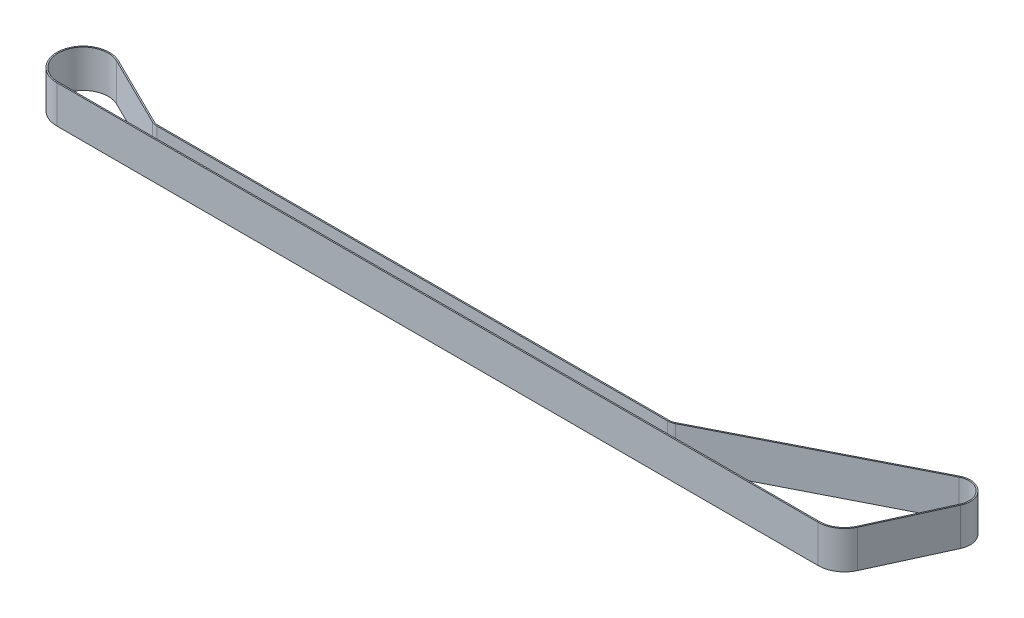
ISO-10303-21;
HEADER;
FILE_DESCRIPTION(('STEP AP214'),'2;1');
FILE_NAME('part.step','',(''),(''),'','','');
FILE_SCHEMA(('AUTOMOTIVE_DESIGN { 1 0 10303 214 1 1 1 1 }'));
ENDSEC;
DATA;
#1=APPLICATION_CONTEXT('core data for automotive mechanical design processes');
#2=APPLICATION_PROTOCOL_DEFINITION('international standard','automotive_design',2000,#1);
#3=PRODUCT_CONTEXT('',#1,'mechanical');
#4=PRODUCT('Part','Part','',(#3));
#5=PRODUCT_RELATED_PRODUCT_CATEGORY('part','',(#4));
#6=PRODUCT_DEFINITION_FORMATION('','',#4);
#7=PRODUCT_DEFINITION_CONTEXT('part definition',#1,'design');
#8=PRODUCT_DEFINITION('design','',#6,#7);
#9=PRODUCT_DEFINITION_SHAPE('','',#8);
#10=(LENGTH_UNIT() NAMED_UNIT(*) SI_UNIT(.MILLI.,.METRE.));
#11=(NAMED_UNIT(*) PLANE_ANGLE_UNIT() SI_UNIT($,.RADIAN.));
#12=(NAMED_UNIT(*) SI_UNIT($,.STERADIAN.) SOLID_ANGLE_UNIT());
#13=UNCERTAINTY_MEASURE_WITH_UNIT(LENGTH_MEASURE(1.E-05),#10,'distance_accuracy_value','');
#14=(GEOMETRIC_REPRESENTATION_CONTEXT(3) GLOBAL_UNCERTAINTY_ASSIGNED_CONTEXT((#13)) GLOBAL_UNIT_ASSIGNED_CONTEXT((#10,
#11,#12)) REPRESENTATION_CONTEXT('',''));
#15=CARTESIAN_POINT('',(0.,0.,0.));
#16=DIRECTION('',(0.,0.,1.));
#17=DIRECTION('',(1.,0.,0.));
#18=AXIS2_PLACEMENT_3D('',#15,#16,#17);
#19=CARTESIAN_POINT('',(238.84,15.,0.));
#20=DIRECTION('',(0.,1.,0.));
#21=DIRECTION('',(0.,0.,1.));
#22=AXIS2_PLACEMENT_3D('',#19,#20,#21);
#23=PLANE('',#22);
#24=CARTESIAN_POINT('',(238.84,15.,0.));
#25=DIRECTION('',(0.,-1.,0.));
#26=DIRECTION('',(0.,0.,1.));
#27=AXIS2_PLACEMENT_3D('',#24,#25,#26);
#28=CIRCLE('',#27,5.);
#29=CARTESIAN_POINT('',(241.10380649228,15.,4.45815883134643));
#30=VERTEX_POINT('',#29);
#31=CARTESIAN_POINT('',(238.84,15.,5.00000000000002));
#32=VERTEX_POINT('',#31);
#33=EDGE_CURVE('E249',#30,#32,#28,.T.);
#34=ORIENTED_EDGE('',*,*,#33,.T.);
#35=DIRECTION('',(-1.,0.,0.));
#36=VECTOR('',#35,1.);
#37=CARTESIAN_POINT('',(238.84,15.,5.00000000000002));
#38=LINE('',#37,#36);
#39=CARTESIAN_POINT('',(35.,15.,5.00000000000002));
#40=VERTEX_POINT('',#39);
#41=EDGE_CURVE('E252',#32,#40,#38,.T.);
#42=ORIENTED_EDGE('',*,*,#41,.T.);
#43=CARTESIAN_POINT('',(35.,15.,0.));
#44=DIRECTION('',(0.,-1.,0.));
#45=DIRECTION('',(0.,0.,1.));
#46=AXIS2_PLACEMENT_3D('',#43,#44,#45);
#47=CIRCLE('',#46,5.00000000000001);
#48=CARTESIAN_POINT('',(32.7857142857143,15.,4.48296093843235));
#49=VERTEX_POINT('',#48);
#50=EDGE_CURVE('E255',#40,#49,#47,.T.);
#51=ORIENTED_EDGE('',*,*,#50,.T.);
#52=DIRECTION('',(-0.896592187686469,0.,-0.442857142857143));
#53=VECTOR('',#52,1.);
#54=CARTESIAN_POINT('',(4.65,15.,-9.41421797070793));
#55=LINE('',#54,#53);
#56=CARTESIAN_POINT('',(4.65,15.,-9.41421797070793));
#57=VERTEX_POINT('',#56);
#58=EDGE_CURVE('E257',#49,#57,#55,.T.);
#59=ORIENTED_EDGE('',*,*,#58,.T.);
#60=CARTESIAN_POINT('',(0.,15.,0.));
#61=DIRECTION('',(0.,1.,0.));
#62=DIRECTION('',(0.,0.,1.));
#63=AXIS2_PLACEMENT_3D('',#60,#61,#62);
#64=CIRCLE('',#63,10.5);
#65=CARTESIAN_POINT('',(0.,15.,10.5));
#66=VERTEX_POINT('',#65);
#67=EDGE_CURVE('E259',#57,#66,#64,.T.);
#68=ORIENTED_EDGE('',*,*,#67,.T.);
#69=DIRECTION('',(1.,0.,0.));
#70=VECTOR('',#69,1.);
#71=CARTESIAN_POINT('',(0.,15.,10.5));
#72=LINE('',#71,#70);
#73=CARTESIAN_POINT('',(303.94,15.,10.5));
#74=VERTEX_POINT('',#73);
#75=EDGE_CURVE('E261',#66,#74,#72,.T.);
#76=ORIENTED_EDGE('',*,*,#75,.T.);
#77=CARTESIAN_POINT('',(303.94,15.,0.));
#78=DIRECTION('',(0.,1.,0.));
#79=DIRECTION('',(0.,0.,1.));
#80=AXIS2_PLACEMENT_3D('',#77,#78,#79);
#81=CIRCLE('',#80,10.5);
#82=CARTESIAN_POINT('',(313.484552813718,15.,4.37624400441116));
#83=VERTEX_POINT('',#82);
#84=EDGE_CURVE('E263',#74,#83,#81,.T.);
#85=ORIENTED_EDGE('',*,*,#84,.T.);
#86=DIRECTION('',(0.416785143277253,0.,-0.909005029877921));
#87=VECTOR('',#86,1.);
#88=CARTESIAN_POINT('',(326.437537724084,15.,-23.8741114254206));
#89=LINE('',#88,#87);
#90=CARTESIAN_POINT('',(326.437537724084,15.,-23.8741114254206));
#91=VERTEX_POINT('',#90);
#92=EDGE_CURVE('E265',#83,#91,#89,.T.);
#93=ORIENTED_EDGE('',*,*,#92,.T.);
#94=CARTESIAN_POINT('',(319.62,15.,-27.));
#95=DIRECTION('',(0.,1.,0.));
#96=DIRECTION('',(0.,0.,1.));
#97=AXIS2_PLACEMENT_3D('',#94,#95,#96);
#98=CIRCLE('',#97,7.50000000000004);
#99=CARTESIAN_POINT('',(316.22429026158,15.,-33.6872382470197));
#100=VERTEX_POINT('',#99);
#101=EDGE_CURVE('E267',#91,#100,#98,.T.);
#102=ORIENTED_EDGE('',*,*,#101,.T.);
#103=DIRECTION('',(-0.891631766269289,0.,0.45276129845594));
#104=VECTOR('',#103,1.);
#105=CARTESIAN_POINT('',(241.10380649228,15.,4.45815883134643));
#106=LINE('',#105,#104);
#107=EDGE_CURVE('E269',#100,#30,#106,.T.);
#108=ORIENTED_EDGE('',*,*,#107,.T.);
#109=EDGE_LOOP('',(#34,#42,#51,#59,#68,#76,#85,#93,#102,#108));
#110=FACE_BOUND('',#109,.T.);
#111=DIRECTION('',(1.,0.,0.));
#112=VECTOR('',#111,1.);
#113=CARTESIAN_POINT('',(0.,15.,10.));
#114=LINE('',#113,#112);
#115=CARTESIAN_POINT('',(0.,15.,10.));
#116=VERTEX_POINT('',#115);
#117=CARTESIAN_POINT('',(303.94,15.,9.99999999999998));
#118=VERTEX_POINT('',#117);
#119=EDGE_CURVE('E178',#116,#118,#114,.T.);
#120=ORIENTED_EDGE('',*,*,#119,.F.);
#121=CARTESIAN_POINT('',(0.,15.,0.));
#122=DIRECTION('',(0.,1.,0.));
#123=DIRECTION('',(0.,0.,1.));
#124=AXIS2_PLACEMENT_3D('',#121,#122,#123);
#125=CIRCLE('',#124,10.);
#126=CARTESIAN_POINT('',(4.42857142857143,15.,-8.96592187686469));
#127=VERTEX_POINT('',#126);
#128=EDGE_CURVE('E170',#127,#116,#125,.T.);
#129=ORIENTED_EDGE('',*,*,#128,.F.);
#130=DIRECTION('',(-0.896592187686469,0.,-0.442857142857143));
#131=VECTOR('',#130,1.);
#132=CARTESIAN_POINT('',(4.42857142857143,15.,-8.96592187686469));
#133=LINE('',#132,#131);
#134=CARTESIAN_POINT('',(32.5642857142857,15.,4.93125703227557));
#135=VERTEX_POINT('',#134);
#136=EDGE_CURVE('E207',#135,#127,#133,.T.);
#137=ORIENTED_EDGE('',*,*,#136,.F.);
#138=CARTESIAN_POINT('',(35.,15.,0.));
#139=DIRECTION('',(0.,-1.,0.));
#140=DIRECTION('',(0.,0.,1.));
#141=AXIS2_PLACEMENT_3D('',#138,#139,#140);
#142=CIRCLE('',#141,5.5);
#143=CARTESIAN_POINT('',(35.,15.,5.5));
#144=VERTEX_POINT('',#143);
#145=EDGE_CURVE('E205',#144,#135,#142,.T.);
#146=ORIENTED_EDGE('',*,*,#145,.F.);
#147=DIRECTION('',(-1.,0.,0.));
#148=VECTOR('',#147,1.);
#149=CARTESIAN_POINT('',(238.84,15.,5.50000000000002));
#150=LINE('',#149,#148);
#151=CARTESIAN_POINT('',(238.84,15.,5.5));
#152=VERTEX_POINT('',#151);
#153=EDGE_CURVE('E203',#152,#144,#150,.T.);
#154=ORIENTED_EDGE('',*,*,#153,.F.);
#155=CARTESIAN_POINT('',(238.84,15.,0.));
#156=DIRECTION('',(0.,-1.,0.));
#157=DIRECTION('',(0.,0.,1.));
#158=AXIS2_PLACEMENT_3D('',#155,#156,#157);
#159=CIRCLE('',#158,5.5);
#160=CARTESIAN_POINT('',(241.330187141508,15.,4.90397471448107));
#161=VERTEX_POINT('',#160);
#162=EDGE_CURVE('E201',#161,#152,#159,.T.);
#163=ORIENTED_EDGE('',*,*,#162,.F.);
#164=DIRECTION('',(-0.891631766269289,0.,0.452761298455939));
#165=VECTOR('',#164,1.);
#166=CARTESIAN_POINT('',(241.330187141508,15.,4.90397471448107));
#167=LINE('',#166,#165);
#168=CARTESIAN_POINT('',(316.450670910808,15.,-33.241422363885));
#169=VERTEX_POINT('',#168);
#170=EDGE_CURVE('E199',#169,#161,#167,.T.);
#171=ORIENTED_EDGE('',*,*,#170,.F.);
#172=CARTESIAN_POINT('',(319.62,15.,-27.));
#173=DIRECTION('',(0.,1.,0.));
#174=DIRECTION('',(0.,0.,1.));
#175=AXIS2_PLACEMENT_3D('',#172,#173,#174);
#176=CIRCLE('',#175,7.00000000000003);
#177=CARTESIAN_POINT('',(325.983035209145,15.,-24.0825039970592));
#178=VERTEX_POINT('',#177);
#179=EDGE_CURVE('E197',#178,#169,#176,.T.);
#180=ORIENTED_EDGE('',*,*,#179,.F.);
#181=DIRECTION('',(0.416785143277253,0.,-0.909005029877921));
#182=VECTOR('',#181,1.);
#183=CARTESIAN_POINT('',(325.983035209145,15.,-24.0825039970592));
#184=LINE('',#183,#182);
#185=CARTESIAN_POINT('',(313.030050298779,15.,4.16785143277253));
#186=VERTEX_POINT('',#185);
#187=EDGE_CURVE('E193',#186,#178,#184,.T.);
#188=ORIENTED_EDGE('',*,*,#187,.F.);
#189=CARTESIAN_POINT('',(303.94,15.,0.));
#190=DIRECTION('',(0.,1.,0.));
#191=DIRECTION('',(0.,0.,1.));
#192=AXIS2_PLACEMENT_3D('',#189,#190,#191);
#193=CIRCLE('',#192,10.);
#194=EDGE_CURVE('E191',#118,#186,#193,.T.);
#195=ORIENTED_EDGE('',*,*,#194,.F.);
#196=EDGE_LOOP('',(#120,#129,#137,#146,#154,#163,#171,#180,#188,#195));
#197=FACE_BOUND('',#196,.T.);
#198=ADVANCED_FACE('F33',(#110,#197),#23,.T.);
#199=CARTESIAN_POINT('',(238.84,0.,0.));
#200=DIRECTION('',(0.,1.,0.));
#201=DIRECTION('',(0.,0.,1.));
#202=AXIS2_PLACEMENT_3D('',#199,#200,#201);
#203=PLANE('',#202);
#204=CARTESIAN_POINT('',(238.84,0.,0.));
#205=DIRECTION('',(0.,-1.,0.));
#206=DIRECTION('',(0.,0.,1.));
#207=AXIS2_PLACEMENT_3D('',#204,#205,#206);
#208=CIRCLE('',#207,5.);
#209=CARTESIAN_POINT('',(241.10380649228,0.,4.45815883134643));
#210=VERTEX_POINT('',#209);
#211=CARTESIAN_POINT('',(238.84,0.,5.00000000000002));
#212=VERTEX_POINT('',#211);
#213=EDGE_CURVE('E186',#210,#212,#208,.T.);
#214=ORIENTED_EDGE('',*,*,#213,.F.);
#215=DIRECTION('',(-0.891631766269289,0.,0.45276129845594));
#216=VECTOR('',#215,1.);
#217=CARTESIAN_POINT('',(241.10380649228,0.,4.45815883134643));
#218=LINE('',#217,#216);
#219=CARTESIAN_POINT('',(316.22429026158,0.,-33.6872382470197));
#220=VERTEX_POINT('',#219);
#221=EDGE_CURVE('E253',#220,#210,#218,.T.);
#222=ORIENTED_EDGE('',*,*,#221,.F.);
#223=CARTESIAN_POINT('',(319.62,0.,-27.));
#224=DIRECTION('',(0.,1.,0.));
#225=DIRECTION('',(0.,0.,1.));
#226=AXIS2_PLACEMENT_3D('',#223,#224,#225);
#227=CIRCLE('',#226,7.50000000000004);
#228=CARTESIAN_POINT('',(326.437537724084,0.,-23.8741114254206));
#229=VERTEX_POINT('',#228);
#230=EDGE_CURVE('E288',#229,#220,#227,.T.);
#231=ORIENTED_EDGE('',*,*,#230,.F.);
#232=DIRECTION('',(0.416785143277253,0.,-0.909005029877921));
#233=VECTOR('',#232,1.);
#234=CARTESIAN_POINT('',(326.437537724084,0.,-23.8741114254206));
#235=LINE('',#234,#233);
#236=CARTESIAN_POINT('',(313.484552813718,0.,4.37624400441116));
#237=VERTEX_POINT('',#236);
#238=EDGE_CURVE('E286',#237,#229,#235,.T.);
#239=ORIENTED_EDGE('',*,*,#238,.F.);
#240=CARTESIAN_POINT('',(303.94,0.,0.));
#241=DIRECTION('',(0.,1.,0.));
#242=DIRECTION('',(0.,0.,1.));
#243=AXIS2_PLACEMENT_3D('',#240,#241,#242);
#244=CIRCLE('',#243,10.5);
#245=CARTESIAN_POINT('',(303.94,0.,10.5));
#246=VERTEX_POINT('',#245);
#247=EDGE_CURVE('E284',#246,#237,#244,.T.);
#248=ORIENTED_EDGE('',*,*,#247,.F.);
#249=DIRECTION('',(1.,0.,0.));
#250=VECTOR('',#249,1.);
#251=CARTESIAN_POINT('',(0.,0.,10.5));
#252=LINE('',#251,#250);
#253=CARTESIAN_POINT('',(0.,0.,10.5));
#254=VERTEX_POINT('',#253);
#255=EDGE_CURVE('E282',#254,#246,#252,.T.);
#256=ORIENTED_EDGE('',*,*,#255,.F.);
#257=CARTESIAN_POINT('',(0.,0.,0.));
#258=DIRECTION('',(0.,1.,0.));
#259=DIRECTION('',(0.,0.,1.));
#260=AXIS2_PLACEMENT_3D('',#257,#258,#259);
#261=CIRCLE('',#260,10.5);
#262=CARTESIAN_POINT('',(4.65,0.,-9.41421797070793));
#263=VERTEX_POINT('',#262);
#264=EDGE_CURVE('E280',#263,#254,#261,.T.);
#265=ORIENTED_EDGE('',*,*,#264,.F.);
#266=DIRECTION('',(-0.896592187686469,0.,-0.442857142857143));
#267=VECTOR('',#266,1.);
#268=CARTESIAN_POINT('',(4.65,0.,-9.41421797070793));
#269=LINE('',#268,#267);
#270=CARTESIAN_POINT('',(32.7857142857143,0.,4.48296093843235));
#271=VERTEX_POINT('',#270);
#272=EDGE_CURVE('E278',#271,#263,#269,.T.);
#273=ORIENTED_EDGE('',*,*,#272,.F.);
#274=CARTESIAN_POINT('',(35.,0.,0.));
#275=DIRECTION('',(0.,-1.,0.));
#276=DIRECTION('',(0.,0.,1.));
#277=AXIS2_PLACEMENT_3D('',#274,#275,#276);
#278=CIRCLE('',#277,5.00000000000001);
#279=CARTESIAN_POINT('',(35.,0.,5.00000000000002));
#280=VERTEX_POINT('',#279);
#281=EDGE_CURVE('E276',#280,#271,#278,.T.);
#282=ORIENTED_EDGE('',*,*,#281,.F.);
#283=DIRECTION('',(-1.,0.,0.));
#284=VECTOR('',#283,1.);
#285=CARTESIAN_POINT('',(238.84,0.,5.00000000000002));
#286=LINE('',#285,#284);
#287=EDGE_CURVE('E274',#212,#280,#286,.T.);
#288=ORIENTED_EDGE('',*,*,#287,.F.);
#289=EDGE_LOOP('',(#214,#222,#231,#239,#248,#256,#265,#273,#282,#288));
#290=FACE_BOUND('',#289,.T.);
#291=CARTESIAN_POINT('',(0.,0.,0.));
#292=DIRECTION('',(0.,1.,0.));
#293=DIRECTION('',(0.,0.,1.));
#294=AXIS2_PLACEMENT_3D('',#291,#292,#293);
#295=CIRCLE('',#294,10.);
#296=CARTESIAN_POINT('',(4.42857142857142,0.,-8.96592187686471));
#297=VERTEX_POINT('',#296);
#298=CARTESIAN_POINT('',(0.,0.,10.));
#299=VERTEX_POINT('',#298);
#300=EDGE_CURVE('E56',#297,#299,#295,.T.);
#301=ORIENTED_EDGE('',*,*,#300,.T.);
#302=DIRECTION('',(1.,0.,0.));
#303=VECTOR('',#302,1.);
#304=CARTESIAN_POINT('',(0.,0.,10.));
#305=LINE('',#304,#303);
#306=CARTESIAN_POINT('',(303.94,0.,9.99999999999998));
#307=VERTEX_POINT('',#306);
#308=EDGE_CURVE('E185',#299,#307,#305,.T.);
#309=ORIENTED_EDGE('',*,*,#308,.T.);
#310=CARTESIAN_POINT('',(303.94,0.,0.));
#311=DIRECTION('',(0.,1.,0.));
#312=DIRECTION('',(0.,0.,1.));
#313=AXIS2_PLACEMENT_3D('',#310,#311,#312);
#314=CIRCLE('',#313,10.);
#315=CARTESIAN_POINT('',(313.030050298779,0.,4.16785143277253));
#316=VERTEX_POINT('',#315);
#317=EDGE_CURVE('E211',#307,#316,#314,.T.);
#318=ORIENTED_EDGE('',*,*,#317,.T.);
#319=DIRECTION('',(0.416785143277253,0.,-0.909005029877921));
#320=VECTOR('',#319,1.);
#321=CARTESIAN_POINT('',(325.983035209145,0.,-24.0825039970592));
#322=LINE('',#321,#320);
#323=CARTESIAN_POINT('',(325.983035209145,0.,-24.0825039970592));
#324=VERTEX_POINT('',#323);
#325=EDGE_CURVE('E214',#316,#324,#322,.T.);
#326=ORIENTED_EDGE('',*,*,#325,.T.);
#327=CARTESIAN_POINT('',(319.62,0.,-27.));
#328=DIRECTION('',(0.,1.,0.));
#329=DIRECTION('',(0.,0.,1.));
#330=AXIS2_PLACEMENT_3D('',#327,#328,#329);
#331=CIRCLE('',#330,7.00000000000003);
#332=CARTESIAN_POINT('',(316.450670910808,0.,-33.241422363885));
#333=VERTEX_POINT('',#332);
#334=EDGE_CURVE('E217',#324,#333,#331,.T.);
#335=ORIENTED_EDGE('',*,*,#334,.T.);
#336=DIRECTION('',(-0.891631766269289,0.,0.452761298455939));
#337=VECTOR('',#336,1.);
#338=CARTESIAN_POINT('',(241.330187141508,0.,4.90397471448107));
#339=LINE('',#338,#337);
#340=CARTESIAN_POINT('',(241.330187141508,0.,4.90397471448107));
#341=VERTEX_POINT('',#340);
#342=EDGE_CURVE('E220',#333,#341,#339,.T.);
#343=ORIENTED_EDGE('',*,*,#342,.T.);
#344=CARTESIAN_POINT('',(238.84,0.,0.));
#345=DIRECTION('',(0.,-1.,0.));
#346=DIRECTION('',(0.,0.,1.));
#347=AXIS2_PLACEMENT_3D('',#344,#345,#346);
#348=CIRCLE('',#347,5.5);
#349=CARTESIAN_POINT('',(238.84,0.,5.5));
#350=VERTEX_POINT('',#349);
#351=EDGE_CURVE('E223',#341,#350,#348,.T.);
#352=ORIENTED_EDGE('',*,*,#351,.T.);
#353=DIRECTION('',(-1.,0.,0.));
#354=VECTOR('',#353,1.);
#355=CARTESIAN_POINT('',(238.84,0.,5.50000000000002));
#356=LINE('',#355,#354);
#357=CARTESIAN_POINT('',(35.,0.,5.5));
#358=VERTEX_POINT('',#357);
#359=EDGE_CURVE('E226',#350,#358,#356,.T.);
#360=ORIENTED_EDGE('',*,*,#359,.T.);
#361=CARTESIAN_POINT('',(35.,0.,0.));
#362=DIRECTION('',(0.,-1.,0.));
#363=DIRECTION('',(0.,0.,1.));
#364=AXIS2_PLACEMENT_3D('',#361,#362,#363);
#365=CIRCLE('',#364,5.5);
#366=CARTESIAN_POINT('',(32.5642857142857,0.,4.93125703227558));
#367=VERTEX_POINT('',#366);
#368=EDGE_CURVE('E229',#358,#367,#365,.T.);
#369=ORIENTED_EDGE('',*,*,#368,.T.);
#370=DIRECTION('',(-0.896592187686469,0.,-0.442857142857143));
#371=VECTOR('',#370,1.);
#372=CARTESIAN_POINT('',(4.42857142857143,0.,-8.96592187686469));
#373=LINE('',#372,#371);
#374=EDGE_CURVE('E179',#367,#297,#373,.T.);
#375=ORIENTED_EDGE('',*,*,#374,.T.);
#376=EDGE_LOOP('',(#301,#309,#318,#326,#335,#343,#352,#360,#369,#375));
#377=FACE_BOUND('',#376,.T.);
#378=ADVANCED_FACE('F324',(#290,#377),#203,.F.);
#379=CARTESIAN_POINT('',(238.84,15.,0.));
#380=DIRECTION('',(0.,-1.,0.));
#381=DIRECTION('',(0.,0.,-1.));
#382=AXIS2_PLACEMENT_3D('',#379,#380,#381);
#383=CYLINDRICAL_SURFACE('',#382,5.);
#384=ORIENTED_EDGE('',*,*,#213,.T.);
#385=DIRECTION('',(0.,-1.,0.));
#386=VECTOR('',#385,1.);
#387=CARTESIAN_POINT('',(238.84,15.,5.00000000000002));
#388=LINE('',#387,#386);
#389=EDGE_CURVE('E11',#32,#212,#388,.T.);
#390=ORIENTED_EDGE('',*,*,#389,.F.);
#391=ORIENTED_EDGE('',*,*,#33,.F.);
#392=DIRECTION('',(0.,-1.,0.));
#393=VECTOR('',#392,1.);
#394=CARTESIAN_POINT('',(241.10380649228,15.,4.45815883134643));
#395=LINE('',#394,#393);
#396=EDGE_CURVE('E271',#30,#210,#395,.T.);
#397=ORIENTED_EDGE('',*,*,#396,.T.);
#398=EDGE_LOOP('',(#384,#390,#391,#397));
#399=FACE_BOUND('',#398,.T.);
#400=ADVANCED_FACE('F35',(#399),#383,.F.);
#401=CARTESIAN_POINT('',(238.84,15.,5.00000000000002));
#402=DIRECTION('',(0.,0.,1.));
#403=DIRECTION('',(1.,0.,0.));
#404=AXIS2_PLACEMENT_3D('',#401,#402,#403);
#405=PLANE('',#404);
#406=ORIENTED_EDGE('',*,*,#287,.T.);
#407=DIRECTION('',(0.,-1.,0.));
#408=VECTOR('',#407,1.);
#409=CARTESIAN_POINT('',(35.,15.,5.00000000000002));
#410=LINE('',#409,#408);
#411=EDGE_CURVE('E41',#40,#280,#410,.T.);
#412=ORIENTED_EDGE('',*,*,#411,.F.);
#413=ORIENTED_EDGE('',*,*,#41,.F.);
#414=ORIENTED_EDGE('',*,*,#389,.T.);
#415=EDGE_LOOP('',(#406,#412,#413,#414));
#416=FACE_BOUND('',#415,.T.);
#417=ADVANCED_FACE('F341',(#416),#405,.F.);
#418=CARTESIAN_POINT('',(35.,15.,0.));
#419=DIRECTION('',(0.,-1.,0.));
#420=DIRECTION('',(0.,0.,-1.));
#421=AXIS2_PLACEMENT_3D('',#418,#419,#420);
#422=CYLINDRICAL_SURFACE('',#421,5.00000000000001);
#423=ORIENTED_EDGE('',*,*,#281,.T.);
#424=DIRECTION('',(0.,-1.,0.));
#425=VECTOR('',#424,1.);
#426=CARTESIAN_POINT('',(32.7857142857143,15.,4.48296093843235));
#427=LINE('',#426,#425);
#428=EDGE_CURVE('E311',#49,#271,#427,.T.);
#429=ORIENTED_EDGE('',*,*,#428,.F.);
#430=ORIENTED_EDGE('',*,*,#50,.F.);
#431=ORIENTED_EDGE('',*,*,#411,.T.);
#432=EDGE_LOOP('',(#423,#429,#430,#431));
#433=FACE_BOUND('',#432,.T.);
#434=ADVANCED_FACE('F318',(#433),#422,.F.);
#435=CARTESIAN_POINT('',(4.65,15.,-9.41421797070793));
#436=DIRECTION('',(-0.442857142857143,0.,0.896592187686469));
#437=DIRECTION('',(0.896592187686469,0.,0.442857142857143));
#438=AXIS2_PLACEMENT_3D('',#435,#436,#437);
#439=PLANE('',#438);
#440=ORIENTED_EDGE('',*,*,#272,.T.);
#441=DIRECTION('',(0.,-1.,0.));
#442=VECTOR('',#441,1.);
#443=CARTESIAN_POINT('',(4.65,15.,-9.41421797070793));
#444=LINE('',#443,#442);
#445=EDGE_CURVE('E308',#57,#263,#444,.T.);
#446=ORIENTED_EDGE('',*,*,#445,.F.);
#447=ORIENTED_EDGE('',*,*,#58,.F.);
#448=ORIENTED_EDGE('',*,*,#428,.T.);
#449=EDGE_LOOP('',(#440,#446,#447,#448));
#450=FACE_BOUND('',#449,.T.);
#451=ADVANCED_FACE('F330',(#450),#439,.F.);
#452=CARTESIAN_POINT('',(0.,15.,0.));
#453=DIRECTION('',(0.,-1.,0.));
#454=DIRECTION('',(0.,0.,-1.));
#455=AXIS2_PLACEMENT_3D('',#452,#453,#454);
#456=CYLINDRICAL_SURFACE('',#455,10.5);
#457=ORIENTED_EDGE('',*,*,#264,.T.);
#458=DIRECTION('',(0.,-1.,0.));
#459=VECTOR('',#458,1.);
#460=CARTESIAN_POINT('',(0.,15.,10.5));
#461=LINE('',#460,#459);
#462=EDGE_CURVE('E305',#66,#254,#461,.T.);
#463=ORIENTED_EDGE('',*,*,#462,.F.);
#464=ORIENTED_EDGE('',*,*,#67,.F.);
#465=ORIENTED_EDGE('',*,*,#445,.T.);
#466=EDGE_LOOP('',(#457,#463,#464,#465));
#467=FACE_BOUND('',#466,.T.);
#468=ADVANCED_FACE('F334',(#467),#456,.T.);
#469=CARTESIAN_POINT('',(0.,15.,10.5));
#470=DIRECTION('',(0.,0.,-1.));
#471=DIRECTION('',(-1.,0.,0.));
#472=AXIS2_PLACEMENT_3D('',#469,#470,#471);
#473=PLANE('',#472);
#474=ORIENTED_EDGE('',*,*,#255,.T.);
#475=DIRECTION('',(0.,-1.,0.));
#476=VECTOR('',#475,1.);
#477=CARTESIAN_POINT('',(303.94,15.,10.5));
#478=LINE('',#477,#476);
#479=EDGE_CURVE('E302',#74,#246,#478,.T.);
#480=ORIENTED_EDGE('',*,*,#479,.F.);
#481=ORIENTED_EDGE('',*,*,#75,.F.);
#482=ORIENTED_EDGE('',*,*,#462,.T.);
#483=EDGE_LOOP('',(#474,#480,#481,#482));
#484=FACE_BOUND('',#483,.T.);
#485=ADVANCED_FACE('F364',(#484),#473,.F.);
#486=CARTESIAN_POINT('',(303.94,15.,0.));
#487=DIRECTION('',(0.,-1.,0.));
#488=DIRECTION('',(0.,0.,-1.));
#489=AXIS2_PLACEMENT_3D('',#486,#487,#488);
#490=CYLINDRICAL_SURFACE('',#489,10.5);
#491=ORIENTED_EDGE('',*,*,#247,.T.);
#492=DIRECTION('',(0.,-1.,0.));
#493=VECTOR('',#492,1.);
#494=CARTESIAN_POINT('',(313.484552813718,15.,4.37624400441116));
#495=LINE('',#494,#493);
#496=EDGE_CURVE('E299',#83,#237,#495,.T.);
#497=ORIENTED_EDGE('',*,*,#496,.F.);
#498=ORIENTED_EDGE('',*,*,#84,.F.);
#499=ORIENTED_EDGE('',*,*,#479,.T.);
#500=EDGE_LOOP('',(#491,#497,#498,#499));
#501=FACE_BOUND('',#500,.T.);
#502=ADVANCED_FACE('F361',(#501),#490,.T.);
#503=CARTESIAN_POINT('',(326.437537724084,15.,-23.8741114254206));
#504=DIRECTION('',(-0.909005029877921,0.,-0.416785143277253));
#505=DIRECTION('',(-0.416785143277253,0.,0.909005029877921));
#506=AXIS2_PLACEMENT_3D('',#503,#504,#505);
#507=PLANE('',#506);
#508=ORIENTED_EDGE('',*,*,#238,.T.);
#509=DIRECTION('',(0.,-1.,0.));
#510=VECTOR('',#509,1.);
#511=CARTESIAN_POINT('',(326.437537724084,15.,-23.8741114254206));
#512=LINE('',#511,#510);
#513=EDGE_CURVE('E296',#91,#229,#512,.T.);
#514=ORIENTED_EDGE('',*,*,#513,.F.);
#515=ORIENTED_EDGE('',*,*,#92,.F.);
#516=ORIENTED_EDGE('',*,*,#496,.T.);
#517=EDGE_LOOP('',(#508,#514,#515,#516));
#518=FACE_BOUND('',#517,.T.);
#519=ADVANCED_FACE('F357',(#518),#507,.F.);
#520=CARTESIAN_POINT('',(319.62,15.,-27.));
#521=DIRECTION('',(0.,-1.,0.));
#522=DIRECTION('',(0.,0.,-1.));
#523=AXIS2_PLACEMENT_3D('',#520,#521,#522);
#524=CYLINDRICAL_SURFACE('',#523,7.50000000000004);
#525=ORIENTED_EDGE('',*,*,#230,.T.);
#526=DIRECTION('',(0.,-1.,0.));
#527=VECTOR('',#526,1.);
#528=CARTESIAN_POINT('',(316.22429026158,15.,-33.6872382470197));
#529=LINE('',#528,#527);
#530=EDGE_CURVE('E293',#100,#220,#529,.T.);
#531=ORIENTED_EDGE('',*,*,#530,.F.);
#532=ORIENTED_EDGE('',*,*,#101,.F.);
#533=ORIENTED_EDGE('',*,*,#513,.T.);
#534=EDGE_LOOP('',(#525,#531,#532,#533));
#535=FACE_BOUND('',#534,.T.);
#536=ADVANCED_FACE('F353',(#535),#524,.T.);
#537=CARTESIAN_POINT('',(241.10380649228,15.,4.45815883134643));
#538=DIRECTION('',(0.45276129845594,0.,0.891631766269289));
#539=DIRECTION('',(0.891631766269289,0.,-0.45276129845594));
#540=AXIS2_PLACEMENT_3D('',#537,#538,#539);
#541=PLANE('',#540);
#542=ORIENTED_EDGE('',*,*,#221,.T.);
#543=ORIENTED_EDGE('',*,*,#396,.F.);
#544=ORIENTED_EDGE('',*,*,#107,.F.);
#545=ORIENTED_EDGE('',*,*,#530,.T.);
#546=EDGE_LOOP('',(#542,#543,#544,#545));
#547=FACE_BOUND('',#546,.T.);
#548=ADVANCED_FACE('F348',(#547),#541,.F.);
#549=CARTESIAN_POINT('',(0.,15.,0.));
#550=DIRECTION('',(0.,-1.,0.));
#551=DIRECTION('',(0.,0.,-1.));
#552=AXIS2_PLACEMENT_3D('',#549,#550,#551);
#553=CYLINDRICAL_SURFACE('',#552,10.);
#554=ORIENTED_EDGE('',*,*,#300,.F.);
#555=DIRECTION('',(0.,-1.,0.));
#556=VECTOR('',#555,1.);
#557=CARTESIAN_POINT('',(4.42857142857143,15.,-8.96592187686469));
#558=LINE('',#557,#556);
#559=EDGE_CURVE('E174',#127,#297,#558,.T.);
#560=ORIENTED_EDGE('',*,*,#559,.F.);
#561=ORIENTED_EDGE('',*,*,#128,.T.);
#562=DIRECTION('',(0.,-1.,0.));
#563=VECTOR('',#562,1.);
#564=CARTESIAN_POINT('',(0.,15.,10.));
#565=LINE('',#564,#563);
#566=EDGE_CURVE('E173',#116,#299,#565,.T.);
#567=ORIENTED_EDGE('',*,*,#566,.T.);
#568=EDGE_LOOP('',(#554,#560,#561,#567));
#569=FACE_BOUND('',#568,.T.);
#570=ADVANCED_FACE('F172',(#569),#553,.F.);
#571=CARTESIAN_POINT('',(0.,15.,10.));
#572=DIRECTION('',(0.,0.,-1.));
#573=DIRECTION('',(-1.,0.,0.));
#574=AXIS2_PLACEMENT_3D('',#571,#572,#573);
#575=PLANE('',#574);
#576=ORIENTED_EDGE('',*,*,#308,.F.);
#577=ORIENTED_EDGE('',*,*,#566,.F.);
#578=ORIENTED_EDGE('',*,*,#119,.T.);
#579=DIRECTION('',(0.,-1.,0.));
#580=VECTOR('',#579,1.);
#581=CARTESIAN_POINT('',(303.94,15.,9.99999999999998));
#582=LINE('',#581,#580);
#583=EDGE_CURVE('E187',#118,#307,#582,.T.);
#584=ORIENTED_EDGE('',*,*,#583,.T.);
#585=EDGE_LOOP('',(#576,#577,#578,#584));
#586=FACE_BOUND('',#585,.T.);
#587=ADVANCED_FACE('F182',(#586),#575,.T.);
#588=CARTESIAN_POINT('',(303.94,15.,0.));
#589=DIRECTION('',(0.,-1.,0.));
#590=DIRECTION('',(0.,0.,-1.));
#591=AXIS2_PLACEMENT_3D('',#588,#589,#590);
#592=CYLINDRICAL_SURFACE('',#591,10.);
#593=ORIENTED_EDGE('',*,*,#317,.F.);
#594=ORIENTED_EDGE('',*,*,#583,.F.);
#595=ORIENTED_EDGE('',*,*,#194,.T.);
#596=DIRECTION('',(0.,-1.,0.));
#597=VECTOR('',#596,1.);
#598=CARTESIAN_POINT('',(313.030050298779,15.,4.16785143277253));
#599=LINE('',#598,#597);
#600=EDGE_CURVE('E246',#186,#316,#599,.T.);
#601=ORIENTED_EDGE('',*,*,#600,.T.);
#602=EDGE_LOOP('',(#593,#594,#595,#601));
#603=FACE_BOUND('',#602,.T.);
#604=ADVANCED_FACE('F410',(#603),#592,.F.);
#605=CARTESIAN_POINT('',(325.983035209145,15.,-24.0825039970592));
#606=DIRECTION('',(-0.909005029877921,0.,-0.416785143277253));
#607=DIRECTION('',(-0.416785143277253,0.,0.909005029877921));
#608=AXIS2_PLACEMENT_3D('',#605,#606,#607);
#609=PLANE('',#608);
#610=ORIENTED_EDGE('',*,*,#325,.F.);
#611=ORIENTED_EDGE('',*,*,#600,.F.);
#612=ORIENTED_EDGE('',*,*,#187,.T.);
#613=DIRECTION('',(0.,-1.,0.));
#614=VECTOR('',#613,1.);
#615=CARTESIAN_POINT('',(325.983035209145,15.,-24.0825039970592));
#616=LINE('',#615,#614);
#617=EDGE_CURVE('E244',#178,#324,#616,.T.);
#618=ORIENTED_EDGE('',*,*,#617,.T.);
#619=EDGE_LOOP('',(#610,#611,#612,#618));
#620=FACE_BOUND('',#619,.T.);
#621=ADVANCED_FACE('F416',(#620),#609,.T.);
#622=CARTESIAN_POINT('',(319.62,15.,-27.));
#623=DIRECTION('',(0.,-1.,0.));
#624=DIRECTION('',(0.,0.,-1.));
#625=AXIS2_PLACEMENT_3D('',#622,#623,#624);
#626=CYLINDRICAL_SURFACE('',#625,7.00000000000003);
#627=ORIENTED_EDGE('',*,*,#334,.F.);
#628=ORIENTED_EDGE('',*,*,#617,.F.);
#629=ORIENTED_EDGE('',*,*,#179,.T.);
#630=DIRECTION('',(0.,-1.,0.));
#631=VECTOR('',#630,1.);
#632=CARTESIAN_POINT('',(316.450670910808,15.,-33.241422363885));
#633=LINE('',#632,#631);
#634=EDGE_CURVE('E242',#169,#333,#633,.T.);
#635=ORIENTED_EDGE('',*,*,#634,.T.);
#636=EDGE_LOOP('',(#627,#628,#629,#635));
#637=FACE_BOUND('',#636,.T.);
#638=ADVANCED_FACE('F424',(#637),#626,.F.);
#639=CARTESIAN_POINT('',(241.330187141508,15.,4.90397471448107));
#640=DIRECTION('',(0.452761298455939,0.,0.891631766269289));
#641=DIRECTION('',(0.891631766269289,0.,-0.452761298455939));
#642=AXIS2_PLACEMENT_3D('',#639,#640,#641);
#643=PLANE('',#642);
#644=ORIENTED_EDGE('',*,*,#342,.F.);
#645=ORIENTED_EDGE('',*,*,#634,.F.);
#646=ORIENTED_EDGE('',*,*,#170,.T.);
#647=DIRECTION('',(0.,-1.,0.));
#648=VECTOR('',#647,1.);
#649=CARTESIAN_POINT('',(241.330187141508,15.,4.90397471448107));
#650=LINE('',#649,#648);
#651=EDGE_CURVE('E240',#161,#341,#650,.T.);
#652=ORIENTED_EDGE('',*,*,#651,.T.);
#653=EDGE_LOOP('',(#644,#645,#646,#652));
#654=FACE_BOUND('',#653,.T.);
#655=ADVANCED_FACE('F432',(#654),#643,.T.);
#656=CARTESIAN_POINT('',(238.84,15.,0.));
#657=DIRECTION('',(0.,-1.,0.));
#658=DIRECTION('',(0.,0.,-1.));
#659=AXIS2_PLACEMENT_3D('',#656,#657,#658);
#660=CYLINDRICAL_SURFACE('',#659,5.5);
#661=ORIENTED_EDGE('',*,*,#351,.F.);
#662=ORIENTED_EDGE('',*,*,#651,.F.);
#663=ORIENTED_EDGE('',*,*,#162,.T.);
#664=DIRECTION('',(0.,-1.,0.));
#665=VECTOR('',#664,1.);
#666=CARTESIAN_POINT('',(238.84,15.,5.5));
#667=LINE('',#666,#665);
#668=EDGE_CURVE('E238',#152,#350,#667,.T.);
#669=ORIENTED_EDGE('',*,*,#668,.T.);
#670=EDGE_LOOP('',(#661,#662,#663,#669));
#671=FACE_BOUND('',#670,.T.);
#672=ADVANCED_FACE('F440',(#671),#660,.T.);
#673=CARTESIAN_POINT('',(238.84,15.,5.50000000000002));
#674=DIRECTION('',(0.,0.,1.));
#675=DIRECTION('',(1.,0.,0.));
#676=AXIS2_PLACEMENT_3D('',#673,#674,#675);
#677=PLANE('',#676);
#678=ORIENTED_EDGE('',*,*,#359,.F.);
#679=ORIENTED_EDGE('',*,*,#668,.F.);
#680=ORIENTED_EDGE('',*,*,#153,.T.);
#681=DIRECTION('',(0.,-1.,0.));
#682=VECTOR('',#681,1.);
#683=CARTESIAN_POINT('',(35.,15.,5.5));
#684=LINE('',#683,#682);
#685=EDGE_CURVE('E236',#144,#358,#684,.T.);
#686=ORIENTED_EDGE('',*,*,#685,.T.);
#687=EDGE_LOOP('',(#678,#679,#680,#686));
#688=FACE_BOUND('',#687,.T.);
#689=ADVANCED_FACE('F448',(#688),#677,.T.);
#690=CARTESIAN_POINT('',(35.,15.,0.));
#691=DIRECTION('',(0.,-1.,0.));
#692=DIRECTION('',(0.,0.,-1.));
#693=AXIS2_PLACEMENT_3D('',#690,#691,#692);
#694=CYLINDRICAL_SURFACE('',#693,5.5);
#695=ORIENTED_EDGE('',*,*,#368,.F.);
#696=ORIENTED_EDGE('',*,*,#685,.F.);
#697=ORIENTED_EDGE('',*,*,#145,.T.);
#698=DIRECTION('',(0.,-1.,0.));
#699=VECTOR('',#698,1.);
#700=CARTESIAN_POINT('',(32.5642857142857,15.,4.93125703227558));
#701=LINE('',#700,#699);
#702=EDGE_CURVE('E48',#135,#367,#701,.T.);
#703=ORIENTED_EDGE('',*,*,#702,.T.);
#704=EDGE_LOOP('',(#695,#696,#697,#703));
#705=FACE_BOUND('',#704,.T.);
#706=ADVANCED_FACE('F456',(#705),#694,.T.);
#707=CARTESIAN_POINT('',(4.42857142857143,15.,-8.96592187686469));
#708=DIRECTION('',(-0.442857142857143,0.,0.896592187686469));
#709=DIRECTION('',(0.896592187686469,0.,0.442857142857143));
#710=AXIS2_PLACEMENT_3D('',#707,#708,#709);
#711=PLANE('',#710);
#712=ORIENTED_EDGE('',*,*,#374,.F.);
#713=ORIENTED_EDGE('',*,*,#702,.F.);
#714=ORIENTED_EDGE('',*,*,#136,.T.);
#715=ORIENTED_EDGE('',*,*,#559,.T.);
#716=EDGE_LOOP('',(#712,#713,#714,#715));
#717=FACE_BOUND('',#716,.T.);
#718=ADVANCED_FACE('F464',(#717),#711,.T.);
#719=CLOSED_SHELL('',(#198,#378,#400,#417,#434,#451,#468,#485,#502,#519,#536,#548,#570,#587,
#604,#621,#638,#655,#672,#689,#706,#718));
#720=MANIFOLD_SOLID_BREP('B2',#719);
#721=ADVANCED_BREP_SHAPE_REPRESENTATION('',(#18,#720),#14);
#722=SHAPE_DEFINITION_REPRESENTATION(#9,#721);
ENDSEC;
END-ISO-10303-21;
